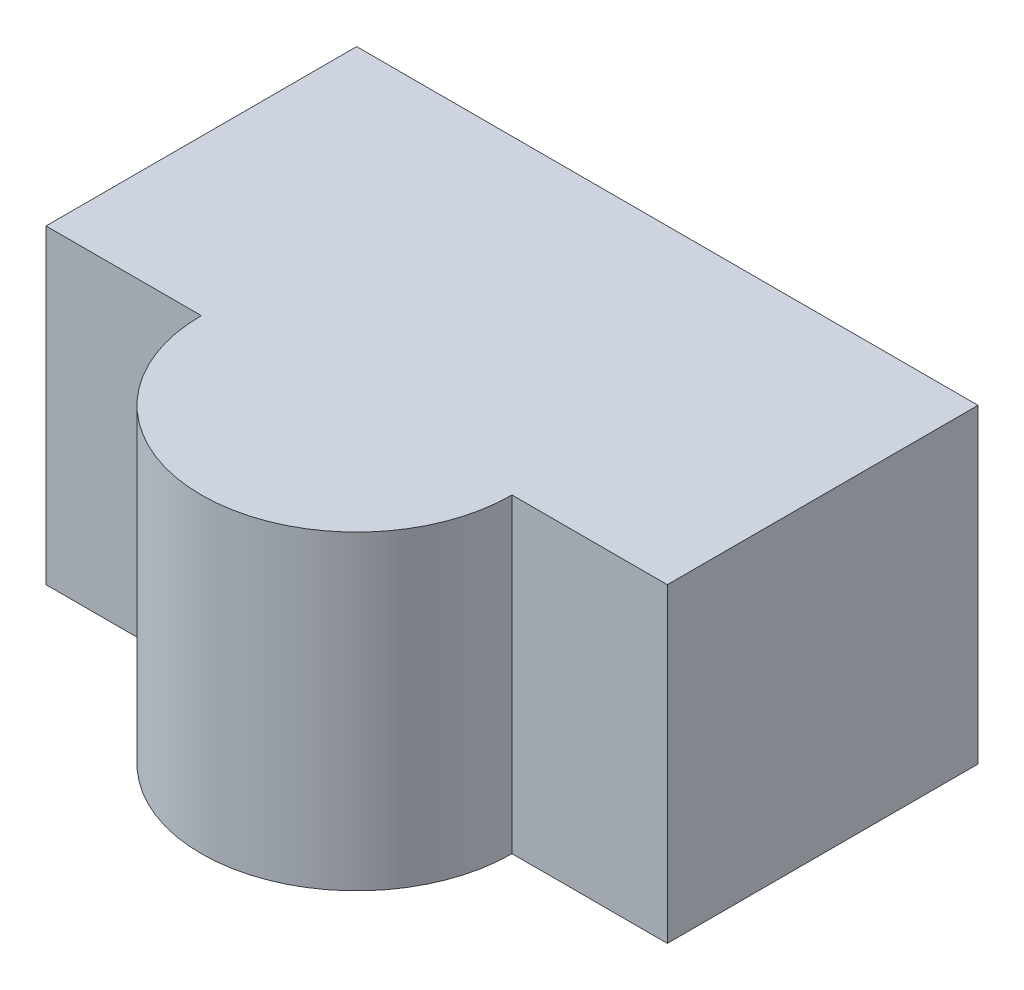
ISO-10303-21;
HEADER;
FILE_DESCRIPTION(('STEP AP214'),'2;1');
FILE_NAME('part.step','',(''),(''),'','','');
FILE_SCHEMA(('AUTOMOTIVE_DESIGN { 1 0 10303 214 1 1 1 1 }'));
ENDSEC;
DATA;
#1=APPLICATION_CONTEXT('core data for automotive mechanical design processes');
#2=APPLICATION_PROTOCOL_DEFINITION('international standard','automotive_design',2000,#1);
#3=PRODUCT_CONTEXT('',#1,'mechanical');
#4=PRODUCT('Part','Part','',(#3));
#5=PRODUCT_RELATED_PRODUCT_CATEGORY('part','',(#4));
#6=PRODUCT_DEFINITION_FORMATION('','',#4);
#7=PRODUCT_DEFINITION_CONTEXT('part definition',#1,'design');
#8=PRODUCT_DEFINITION('design','',#6,#7);
#9=PRODUCT_DEFINITION_SHAPE('','',#8);
#10=(LENGTH_UNIT() NAMED_UNIT(*) SI_UNIT(.MILLI.,.METRE.));
#11=(NAMED_UNIT(*) PLANE_ANGLE_UNIT() SI_UNIT($,.RADIAN.));
#12=(NAMED_UNIT(*) SI_UNIT($,.STERADIAN.) SOLID_ANGLE_UNIT());
#13=UNCERTAINTY_MEASURE_WITH_UNIT(LENGTH_MEASURE(1.E-05),#10,'distance_accuracy_value','');
#14=(GEOMETRIC_REPRESENTATION_CONTEXT(3) GLOBAL_UNCERTAINTY_ASSIGNED_CONTEXT((#13)) GLOBAL_UNIT_ASSIGNED_CONTEXT((#10,
#11,#12)) REPRESENTATION_CONTEXT('',''));
#15=CARTESIAN_POINT('',(0.,0.,0.));
#16=DIRECTION('',(0.,0.,1.));
#17=DIRECTION('',(1.,0.,0.));
#18=AXIS2_PLACEMENT_3D('',#15,#16,#17);
#19=CARTESIAN_POINT('',(-20.,20.,10.));
#20=DIRECTION('',(0.,0.,-1.));
#21=DIRECTION('',(-1.,0.,0.));
#22=AXIS2_PLACEMENT_3D('',#19,#20,#21);
#23=PLANE('',#22);
#24=DIRECTION('',(1.,0.,0.));
#25=VECTOR('',#24,1.);
#26=CARTESIAN_POINT('',(-20.,0.,10.));
#27=LINE('',#26,#25);
#28=CARTESIAN_POINT('',(-20.,0.,10.));
#29=VERTEX_POINT('',#28);
#30=CARTESIAN_POINT('',(-10.,0.,10.));
#31=VERTEX_POINT('',#30);
#32=EDGE_CURVE('E108',#29,#31,#27,.T.);
#33=ORIENTED_EDGE('',*,*,#32,.T.);
#34=DIRECTION('',(0.,1.,0.));
#35=VECTOR('',#34,1.);
#36=CARTESIAN_POINT('',(-10.,0.,10.));
#37=LINE('',#36,#35);
#38=CARTESIAN_POINT('',(-10.,20.,10.));
#39=VERTEX_POINT('',#38);
#40=EDGE_CURVE('E67',#31,#39,#37,.T.);
#41=ORIENTED_EDGE('',*,*,#40,.T.);
#42=DIRECTION('',(1.,0.,0.));
#43=VECTOR('',#42,1.);
#44=CARTESIAN_POINT('',(-20.,20.,10.));
#45=LINE('',#44,#43);
#46=CARTESIAN_POINT('',(-20.,20.,10.));
#47=VERTEX_POINT('',#46);
#48=EDGE_CURVE('E137',#47,#39,#45,.T.);
#49=ORIENTED_EDGE('',*,*,#48,.F.);
#50=DIRECTION('',(0.,-1.,0.));
#51=VECTOR('',#50,1.);
#52=CARTESIAN_POINT('',(-20.,20.,10.));
#53=LINE('',#52,#51);
#54=EDGE_CURVE('E151',#47,#29,#53,.T.);
#55=ORIENTED_EDGE('',*,*,#54,.T.);
#56=EDGE_LOOP('',(#33,#41,#49,#55));
#57=FACE_BOUND('',#56,.T.);
#58=ADVANCED_FACE('F43',(#57),#23,.F.);
#59=CARTESIAN_POINT('',(20.,20.,-10.));
#60=DIRECTION('',(-1.,0.,0.));
#61=DIRECTION('',(0.,0.,1.));
#62=AXIS2_PLACEMENT_3D('',#59,#60,#61);
#63=PLANE('',#62);
#64=DIRECTION('',(0.,0.,-1.));
#65=VECTOR('',#64,1.);
#66=CARTESIAN_POINT('',(20.,0.,-10.));
#67=LINE('',#66,#65);
#68=CARTESIAN_POINT('',(20.,0.,10.));
#69=VERTEX_POINT('',#68);
#70=CARTESIAN_POINT('',(20.,0.,-10.));
#71=VERTEX_POINT('',#70);
#72=EDGE_CURVE('E105',#69,#71,#67,.T.);
#73=ORIENTED_EDGE('',*,*,#72,.T.);
#74=DIRECTION('',(0.,-1.,0.));
#75=VECTOR('',#74,1.);
#76=CARTESIAN_POINT('',(20.,20.,-10.));
#77=LINE('',#76,#75);
#78=CARTESIAN_POINT('',(20.,20.,-10.));
#79=VERTEX_POINT('',#78);
#80=EDGE_CURVE('E11',#79,#71,#77,.T.);
#81=ORIENTED_EDGE('',*,*,#80,.F.);
#82=DIRECTION('',(0.,0.,-1.));
#83=VECTOR('',#82,1.);
#84=CARTESIAN_POINT('',(20.,20.,-10.));
#85=LINE('',#84,#83);
#86=CARTESIAN_POINT('',(20.,20.,10.));
#87=VERTEX_POINT('',#86);
#88=EDGE_CURVE('E127',#87,#79,#85,.T.);
#89=ORIENTED_EDGE('',*,*,#88,.F.);
#90=DIRECTION('',(0.,-1.,0.));
#91=VECTOR('',#90,1.);
#92=CARTESIAN_POINT('',(20.,20.,10.));
#93=LINE('',#92,#91);
#94=EDGE_CURVE('E140',#87,#69,#93,.T.);
#95=ORIENTED_EDGE('',*,*,#94,.T.);
#96=EDGE_LOOP('',(#73,#81,#89,#95));
#97=FACE_BOUND('',#96,.T.);
#98=ADVANCED_FACE('F45',(#97),#63,.F.);
#99=CARTESIAN_POINT('',(-20.,20.,-10.));
#100=DIRECTION('',(0.,0.,1.));
#101=DIRECTION('',(1.,0.,0.));
#102=AXIS2_PLACEMENT_3D('',#99,#100,#101);
#103=PLANE('',#102);
#104=DIRECTION('',(-1.,0.,0.));
#105=VECTOR('',#104,1.);
#106=CARTESIAN_POINT('',(-20.,0.,-10.));
#107=LINE('',#106,#105);
#108=CARTESIAN_POINT('',(-20.,0.,-10.));
#109=VERTEX_POINT('',#108);
#110=EDGE_CURVE('E143',#71,#109,#107,.T.);
#111=ORIENTED_EDGE('',*,*,#110,.T.);
#112=DIRECTION('',(0.,-1.,0.));
#113=VECTOR('',#112,1.);
#114=CARTESIAN_POINT('',(-20.,20.,-10.));
#115=LINE('',#114,#113);
#116=CARTESIAN_POINT('',(-20.,20.,-10.));
#117=VERTEX_POINT('',#116);
#118=EDGE_CURVE('E52',#117,#109,#115,.T.);
#119=ORIENTED_EDGE('',*,*,#118,.F.);
#120=DIRECTION('',(-1.,0.,0.));
#121=VECTOR('',#120,1.);
#122=CARTESIAN_POINT('',(-20.,20.,-10.));
#123=LINE('',#122,#121);
#124=EDGE_CURVE('E131',#79,#117,#123,.T.);
#125=ORIENTED_EDGE('',*,*,#124,.F.);
#126=ORIENTED_EDGE('',*,*,#80,.T.);
#127=EDGE_LOOP('',(#111,#119,#125,#126));
#128=FACE_BOUND('',#127,.T.);
#129=ADVANCED_FACE('F167',(#128),#103,.F.);
#130=CARTESIAN_POINT('',(-20.,20.,-10.));
#131=DIRECTION('',(1.,0.,0.));
#132=DIRECTION('',(0.,0.,-1.));
#133=AXIS2_PLACEMENT_3D('',#130,#131,#132);
#134=PLANE('',#133);
#135=DIRECTION('',(0.,0.,1.));
#136=VECTOR('',#135,1.);
#137=CARTESIAN_POINT('',(-20.,0.,-10.));
#138=LINE('',#137,#136);
#139=EDGE_CURVE('E109',#109,#29,#138,.T.);
#140=ORIENTED_EDGE('',*,*,#139,.T.);
#141=ORIENTED_EDGE('',*,*,#54,.F.);
#142=DIRECTION('',(0.,0.,1.));
#143=VECTOR('',#142,1.);
#144=CARTESIAN_POINT('',(-20.,20.,-10.));
#145=LINE('',#144,#143);
#146=EDGE_CURVE('E134',#117,#47,#145,.T.);
#147=ORIENTED_EDGE('',*,*,#146,.F.);
#148=ORIENTED_EDGE('',*,*,#118,.T.);
#149=EDGE_LOOP('',(#140,#141,#147,#148));
#150=FACE_BOUND('',#149,.T.);
#151=ADVANCED_FACE('F160',(#150),#134,.F.);
#152=CARTESIAN_POINT('',(9.99999999999999,20.,10.));
#153=VERTEX_POINT('',#152);
#154=EDGE_CURVE('E59',#153,#87,#45,.T.);
#155=ORIENTED_EDGE('',*,*,#154,.F.);
#156=DIRECTION('',(0.,1.,0.));
#157=VECTOR('',#156,1.);
#158=CARTESIAN_POINT('',(9.99999999999999,0.,10.));
#159=LINE('',#158,#157);
#160=CARTESIAN_POINT('',(9.99999999999999,0.,10.));
#161=VERTEX_POINT('',#160);
#162=EDGE_CURVE('E111',#161,#153,#159,.T.);
#163=ORIENTED_EDGE('',*,*,#162,.F.);
#164=EDGE_CURVE('E99',#161,#69,#27,.T.);
#165=ORIENTED_EDGE('',*,*,#164,.T.);
#166=ORIENTED_EDGE('',*,*,#94,.F.);
#167=EDGE_LOOP('',(#155,#163,#165,#166));
#168=FACE_BOUND('',#167,.T.);
#169=ADVANCED_FACE('F112',(#168),#23,.F.);
#170=CARTESIAN_POINT('',(0.,20.,0.));
#171=DIRECTION('',(0.,1.,0.));
#172=DIRECTION('',(0.,0.,1.));
#173=AXIS2_PLACEMENT_3D('',#170,#171,#172);
#174=PLANE('',#173);
#175=ORIENTED_EDGE('',*,*,#88,.T.);
#176=ORIENTED_EDGE('',*,*,#124,.T.);
#177=ORIENTED_EDGE('',*,*,#146,.T.);
#178=ORIENTED_EDGE('',*,*,#48,.T.);
#179=CARTESIAN_POINT('',(0.,20.,10.));
#180=DIRECTION('',(0.,1.,0.));
#181=DIRECTION('',(0.,0.,1.));
#182=AXIS2_PLACEMENT_3D('',#179,#180,#181);
#183=CIRCLE('',#182,10.);
#184=EDGE_CURVE('E120',#39,#153,#183,.T.);
#185=ORIENTED_EDGE('',*,*,#184,.T.);
#186=ORIENTED_EDGE('',*,*,#154,.T.);
#187=EDGE_LOOP('',(#175,#176,#177,#178,#185,#186));
#188=FACE_BOUND('',#187,.T.);
#189=ADVANCED_FACE('F164',(#188),#174,.T.);
#190=CARTESIAN_POINT('',(0.,0.,0.));
#191=DIRECTION('',(0.,1.,0.));
#192=DIRECTION('',(0.,0.,1.));
#193=AXIS2_PLACEMENT_3D('',#190,#191,#192);
#194=PLANE('',#193);
#195=ORIENTED_EDGE('',*,*,#72,.F.);
#196=ORIENTED_EDGE('',*,*,#164,.F.);
#197=CARTESIAN_POINT('',(0.,0.,10.));
#198=DIRECTION('',(0.,1.,0.));
#199=DIRECTION('',(0.,0.,1.));
#200=AXIS2_PLACEMENT_3D('',#197,#198,#199);
#201=CIRCLE('',#200,10.);
#202=EDGE_CURVE('E103',#31,#161,#201,.T.);
#203=ORIENTED_EDGE('',*,*,#202,.F.);
#204=ORIENTED_EDGE('',*,*,#32,.F.);
#205=ORIENTED_EDGE('',*,*,#139,.F.);
#206=ORIENTED_EDGE('',*,*,#110,.F.);
#207=EDGE_LOOP('',(#195,#196,#203,#204,#205,#206));
#208=FACE_BOUND('',#207,.T.);
#209=ADVANCED_FACE('F100',(#208),#194,.F.);
#210=CARTESIAN_POINT('',(0.,0.,10.));
#211=DIRECTION('',(0.,1.,0.));
#212=DIRECTION('',(0.,0.,1.));
#213=AXIS2_PLACEMENT_3D('',#210,#211,#212);
#214=CYLINDRICAL_SURFACE('',#213,10.);
#215=ORIENTED_EDGE('',*,*,#184,.F.);
#216=ORIENTED_EDGE('',*,*,#40,.F.);
#217=ORIENTED_EDGE('',*,*,#202,.T.);
#218=ORIENTED_EDGE('',*,*,#162,.T.);
#219=EDGE_LOOP('',(#215,#216,#217,#218));
#220=FACE_BOUND('',#219,.T.);
#221=ADVANCED_FACE('F118',(#220),#214,.T.);
#222=CLOSED_SHELL('',(#58,#98,#129,#151,#169,#189,#209,#221));
#223=MANIFOLD_SOLID_BREP('B2',#222);
#224=ADVANCED_BREP_SHAPE_REPRESENTATION('',(#18,#223),#14);
#225=SHAPE_DEFINITION_REPRESENTATION(#9,#224);
ENDSEC;
END-ISO-10303-21;
